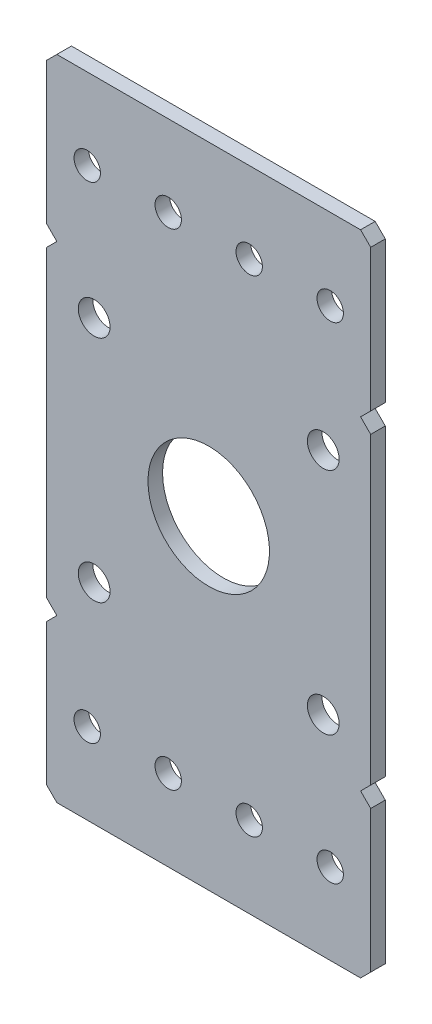
ISO-10303-21;
HEADER;
FILE_DESCRIPTION(('STEP AP214'),'2;1');
FILE_NAME('part.step','',(''),(''),'','','');
FILE_SCHEMA(('AUTOMOTIVE_DESIGN { 1 0 10303 214 1 1 1 1 }'));
ENDSEC;
DATA;
#1=APPLICATION_CONTEXT('core data for automotive mechanical design processes');
#2=APPLICATION_PROTOCOL_DEFINITION('international standard','automotive_design',2000,#1);
#3=PRODUCT_CONTEXT('',#1,'mechanical');
#4=PRODUCT('Part','Part','',(#3));
#5=PRODUCT_RELATED_PRODUCT_CATEGORY('part','',(#4));
#6=PRODUCT_DEFINITION_FORMATION('','',#4);
#7=PRODUCT_DEFINITION_CONTEXT('part definition',#1,'design');
#8=PRODUCT_DEFINITION('design','',#6,#7);
#9=PRODUCT_DEFINITION_SHAPE('','',#8);
#10=(LENGTH_UNIT() NAMED_UNIT(*) SI_UNIT(.MILLI.,.METRE.));
#11=(NAMED_UNIT(*) PLANE_ANGLE_UNIT() SI_UNIT($,.RADIAN.));
#12=(NAMED_UNIT(*) SI_UNIT($,.STERADIAN.) SOLID_ANGLE_UNIT());
#13=UNCERTAINTY_MEASURE_WITH_UNIT(LENGTH_MEASURE(1.E-05),#10,'distance_accuracy_value','');
#14=(GEOMETRIC_REPRESENTATION_CONTEXT(3) GLOBAL_UNCERTAINTY_ASSIGNED_CONTEXT((#13)) GLOBAL_UNIT_ASSIGNED_CONTEXT((#10,
#11,#12)) REPRESENTATION_CONTEXT('',''));
#15=CARTESIAN_POINT('',(0.,0.,0.));
#16=DIRECTION('',(0.,0.,1.));
#17=DIRECTION('',(1.,0.,0.));
#18=AXIS2_PLACEMENT_3D('',#15,#16,#17);
#19=CARTESIAN_POINT('',(25.4,-49.2125,0.));
#20=DIRECTION('',(1.,0.,0.));
#21=DIRECTION('',(0.,1.,0.));
#22=AXIS2_PLACEMENT_3D('',#19,#20,#21);
#23=PLANE('',#22);
#24=DIRECTION('',(0.,1.,0.));
#25=VECTOR('',#24,1.);
#26=CARTESIAN_POINT('',(25.4,-49.2125,2.286));
#27=LINE('',#26,#25);
#28=CARTESIAN_POINT('',(25.4,-49.2125,2.286));
#29=VERTEX_POINT('',#28);
#30=CARTESIAN_POINT('',(25.4,-26.9875,2.286));
#31=VERTEX_POINT('',#30);
#32=EDGE_CURVE('E202',#29,#31,#27,.T.);
#33=ORIENTED_EDGE('',*,*,#32,.F.);
#34=DIRECTION('',(0.,0.,1.));
#35=VECTOR('',#34,1.);
#36=CARTESIAN_POINT('',(25.4,-49.2125,0.));
#37=LINE('',#36,#35);
#38=CARTESIAN_POINT('',(25.4,-49.2125,0.));
#39=VERTEX_POINT('',#38);
#40=EDGE_CURVE('E11',#39,#29,#37,.T.);
#41=ORIENTED_EDGE('',*,*,#40,.F.);
#42=DIRECTION('',(0.,1.,0.));
#43=VECTOR('',#42,1.);
#44=CARTESIAN_POINT('',(25.4,-49.2125,0.));
#45=LINE('',#44,#43);
#46=CARTESIAN_POINT('',(25.4,-26.9875,0.));
#47=VERTEX_POINT('',#46);
#48=EDGE_CURVE('E259',#39,#47,#45,.T.);
#49=ORIENTED_EDGE('',*,*,#48,.T.);
#50=DIRECTION('',(0.,0.,1.));
#51=VECTOR('',#50,1.);
#52=CARTESIAN_POINT('',(25.4,-26.9875,0.));
#53=LINE('',#52,#51);
#54=EDGE_CURVE('E36',#47,#31,#53,.T.);
#55=ORIENTED_EDGE('',*,*,#54,.T.);
#56=EDGE_LOOP('',(#33,#41,#49,#55));
#57=FACE_BOUND('',#56,.T.);
#58=ADVANCED_FACE('F33',(#57),#23,.T.);
#59=CARTESIAN_POINT('',(23.8125,-50.8,0.));
#60=DIRECTION('',(0.707106781186548,-0.707106781186548,0.));
#61=DIRECTION('',(0.707106781186548,0.707106781186548,0.));
#62=AXIS2_PLACEMENT_3D('',#59,#60,#61);
#63=PLANE('',#62);
#64=DIRECTION('',(0.707106781186548,0.707106781186548,0.));
#65=VECTOR('',#64,1.);
#66=CARTESIAN_POINT('',(23.8125,-50.8,2.286));
#67=LINE('',#66,#65);
#68=CARTESIAN_POINT('',(23.8125,-50.8,2.286));
#69=VERTEX_POINT('',#68);
#70=EDGE_CURVE('E257',#69,#29,#67,.T.);
#71=ORIENTED_EDGE('',*,*,#70,.F.);
#72=DIRECTION('',(0.,0.,1.));
#73=VECTOR('',#72,1.);
#74=CARTESIAN_POINT('',(23.8125,-50.8,0.));
#75=LINE('',#74,#73);
#76=CARTESIAN_POINT('',(23.8125,-50.8,0.));
#77=VERTEX_POINT('',#76);
#78=EDGE_CURVE('E42',#77,#69,#75,.T.);
#79=ORIENTED_EDGE('',*,*,#78,.F.);
#80=DIRECTION('',(0.707106781186548,0.707106781186548,0.));
#81=VECTOR('',#80,1.);
#82=CARTESIAN_POINT('',(23.8125,-50.8,0.));
#83=LINE('',#82,#81);
#84=EDGE_CURVE('E192',#77,#39,#83,.T.);
#85=ORIENTED_EDGE('',*,*,#84,.T.);
#86=ORIENTED_EDGE('',*,*,#40,.T.);
#87=EDGE_LOOP('',(#71,#79,#85,#86));
#88=FACE_BOUND('',#87,.T.);
#89=ADVANCED_FACE('F295',(#88),#63,.T.);
#90=CARTESIAN_POINT('',(-23.8125,-50.8,0.));
#91=DIRECTION('',(0.,-1.,0.));
#92=DIRECTION('',(0.,0.,-1.));
#93=AXIS2_PLACEMENT_3D('',#90,#91,#92);
#94=PLANE('',#93);
#95=DIRECTION('',(1.,0.,0.));
#96=VECTOR('',#95,1.);
#97=CARTESIAN_POINT('',(-23.8125,-50.8,2.286));
#98=LINE('',#97,#96);
#99=CARTESIAN_POINT('',(-23.8125,-50.8,2.286));
#100=VERTEX_POINT('',#99);
#101=EDGE_CURVE('E179',#100,#69,#98,.T.);
#102=ORIENTED_EDGE('',*,*,#101,.F.);
#103=DIRECTION('',(0.,0.,1.));
#104=VECTOR('',#103,1.);
#105=CARTESIAN_POINT('',(-23.8125,-50.8,0.));
#106=LINE('',#105,#104);
#107=CARTESIAN_POINT('',(-23.8125,-50.8,0.));
#108=VERTEX_POINT('',#107);
#109=EDGE_CURVE('E174',#108,#100,#106,.T.);
#110=ORIENTED_EDGE('',*,*,#109,.F.);
#111=DIRECTION('',(1.,0.,0.));
#112=VECTOR('',#111,1.);
#113=CARTESIAN_POINT('',(-23.8125,-50.8,0.));
#114=LINE('',#113,#112);
#115=EDGE_CURVE('E177',#108,#77,#114,.T.);
#116=ORIENTED_EDGE('',*,*,#115,.T.);
#117=ORIENTED_EDGE('',*,*,#78,.T.);
#118=EDGE_LOOP('',(#102,#110,#116,#117));
#119=FACE_BOUND('',#118,.T.);
#120=ADVANCED_FACE('F176',(#119),#94,.T.);
#121=CARTESIAN_POINT('',(-25.4,-49.2125,0.));
#122=DIRECTION('',(-0.707106781186548,-0.707106781186548,0.));
#123=DIRECTION('',(0.707106781186548,-0.707106781186548,0.));
#124=AXIS2_PLACEMENT_3D('',#121,#122,#123);
#125=PLANE('',#124);
#126=DIRECTION('',(0.707106781186548,-0.707106781186548,0.));
#127=VECTOR('',#126,1.);
#128=CARTESIAN_POINT('',(-25.4,-49.2125,2.286));
#129=LINE('',#128,#127);
#130=CARTESIAN_POINT('',(-25.4,-49.2125,2.286));
#131=VERTEX_POINT('',#130);
#132=EDGE_CURVE('E254',#131,#100,#129,.T.);
#133=ORIENTED_EDGE('',*,*,#132,.F.);
#134=DIRECTION('',(0.,0.,1.));
#135=VECTOR('',#134,1.);
#136=CARTESIAN_POINT('',(-25.4,-49.2125,0.));
#137=LINE('',#136,#135);
#138=CARTESIAN_POINT('',(-25.4,-49.2125,0.));
#139=VERTEX_POINT('',#138);
#140=EDGE_CURVE('E184',#139,#131,#137,.T.);
#141=ORIENTED_EDGE('',*,*,#140,.F.);
#142=DIRECTION('',(0.707106781186548,-0.707106781186548,0.));
#143=VECTOR('',#142,1.);
#144=CARTESIAN_POINT('',(-25.4,-49.2125,0.));
#145=LINE('',#144,#143);
#146=EDGE_CURVE('E190',#139,#108,#145,.T.);
#147=ORIENTED_EDGE('',*,*,#146,.T.);
#148=ORIENTED_EDGE('',*,*,#109,.T.);
#149=EDGE_LOOP('',(#133,#141,#147,#148));
#150=FACE_BOUND('',#149,.T.);
#151=ADVANCED_FACE('F194',(#150),#125,.T.);
#152=CARTESIAN_POINT('',(-25.4,-26.9875,0.));
#153=DIRECTION('',(-1.,0.,0.));
#154=DIRECTION('',(0.,-1.,0.));
#155=AXIS2_PLACEMENT_3D('',#152,#153,#154);
#156=PLANE('',#155);
#157=DIRECTION('',(0.,-1.,0.));
#158=VECTOR('',#157,1.);
#159=CARTESIAN_POINT('',(-25.4,-26.9875,2.286));
#160=LINE('',#159,#158);
#161=CARTESIAN_POINT('',(-25.4,-26.9875,2.286));
#162=VERTEX_POINT('',#161);
#163=EDGE_CURVE('E251',#162,#131,#160,.T.);
#164=ORIENTED_EDGE('',*,*,#163,.F.);
#165=DIRECTION('',(0.,0.,1.));
#166=VECTOR('',#165,1.);
#167=CARTESIAN_POINT('',(-25.4,-26.9875,0.));
#168=LINE('',#167,#166);
#169=CARTESIAN_POINT('',(-25.4,-26.9875,0.));
#170=VERTEX_POINT('',#169);
#171=EDGE_CURVE('E263',#170,#162,#168,.T.);
#172=ORIENTED_EDGE('',*,*,#171,.F.);
#173=DIRECTION('',(0.,-1.,0.));
#174=VECTOR('',#173,1.);
#175=CARTESIAN_POINT('',(-25.4,-26.9875,0.));
#176=LINE('',#175,#174);
#177=EDGE_CURVE('E195',#170,#139,#176,.T.);
#178=ORIENTED_EDGE('',*,*,#177,.T.);
#179=ORIENTED_EDGE('',*,*,#140,.T.);
#180=EDGE_LOOP('',(#164,#172,#178,#179));
#181=FACE_BOUND('',#180,.T.);
#182=ADVANCED_FACE('F308',(#181),#156,.T.);
#183=CARTESIAN_POINT('',(-23.8125,-25.4,0.));
#184=DIRECTION('',(-0.707106781186554,0.70710678118654,0.));
#185=DIRECTION('',(-0.707106781186541,-0.707106781186555,0.));
#186=AXIS2_PLACEMENT_3D('',#183,#184,#185);
#187=PLANE('',#186);
#188=DIRECTION('',(-0.70710678118654,-0.707106781186554,0.));
#189=VECTOR('',#188,1.);
#190=CARTESIAN_POINT('',(-23.8125,-25.4,2.286));
#191=LINE('',#190,#189);
#192=CARTESIAN_POINT('',(-23.8125,-25.4,2.286));
#193=VERTEX_POINT('',#192);
#194=EDGE_CURVE('E248',#193,#162,#191,.T.);
#195=ORIENTED_EDGE('',*,*,#194,.F.);
#196=DIRECTION('',(0.,0.,1.));
#197=VECTOR('',#196,1.);
#198=CARTESIAN_POINT('',(-23.8125,-25.4,0.));
#199=LINE('',#198,#197);
#200=CARTESIAN_POINT('',(-23.8125,-25.4,0.));
#201=VERTEX_POINT('',#200);
#202=EDGE_CURVE('E265',#201,#193,#199,.T.);
#203=ORIENTED_EDGE('',*,*,#202,.F.);
#204=DIRECTION('',(-0.70710678118654,-0.707106781186554,0.));
#205=VECTOR('',#204,1.);
#206=CARTESIAN_POINT('',(-23.8125,-25.4,0.));
#207=LINE('',#206,#205);
#208=EDGE_CURVE('E197',#201,#170,#207,.T.);
#209=ORIENTED_EDGE('',*,*,#208,.T.);
#210=ORIENTED_EDGE('',*,*,#171,.T.);
#211=EDGE_LOOP('',(#195,#203,#209,#210));
#212=FACE_BOUND('',#211,.T.);
#213=ADVANCED_FACE('F311',(#212),#187,.T.);
#214=CARTESIAN_POINT('',(-25.4,-23.8125,0.));
#215=DIRECTION('',(-0.707106781186542,-0.707106781186553,0.));
#216=DIRECTION('',(0.707106781186553,-0.707106781186542,0.));
#217=AXIS2_PLACEMENT_3D('',#214,#215,#216);
#218=PLANE('',#217);
#219=DIRECTION('',(0.707106781186553,-0.707106781186542,0.));
#220=VECTOR('',#219,1.);
#221=CARTESIAN_POINT('',(-25.4,-23.8125,2.286));
#222=LINE('',#221,#220);
#223=CARTESIAN_POINT('',(-25.4,-23.8125,2.286));
#224=VERTEX_POINT('',#223);
#225=EDGE_CURVE('E245',#224,#193,#222,.T.);
#226=ORIENTED_EDGE('',*,*,#225,.F.);
#227=DIRECTION('',(0.,0.,1.));
#228=VECTOR('',#227,1.);
#229=CARTESIAN_POINT('',(-25.4,-23.8125,0.));
#230=LINE('',#229,#228);
#231=CARTESIAN_POINT('',(-25.4,-23.8125,0.));
#232=VERTEX_POINT('',#231);
#233=EDGE_CURVE('E267',#232,#224,#230,.T.);
#234=ORIENTED_EDGE('',*,*,#233,.F.);
#235=DIRECTION('',(0.707106781186553,-0.707106781186542,0.));
#236=VECTOR('',#235,1.);
#237=CARTESIAN_POINT('',(-25.4,-23.8125,0.));
#238=LINE('',#237,#236);
#239=EDGE_CURVE('E551',#232,#201,#238,.T.);
#240=ORIENTED_EDGE('',*,*,#239,.T.);
#241=ORIENTED_EDGE('',*,*,#202,.T.);
#242=EDGE_LOOP('',(#226,#234,#240,#241));
#243=FACE_BOUND('',#242,.T.);
#244=ADVANCED_FACE('F315',(#243),#218,.T.);
#245=CARTESIAN_POINT('',(-25.4,23.8125,0.));
#246=DIRECTION('',(-1.,0.,0.));
#247=DIRECTION('',(0.,-1.,0.));
#248=AXIS2_PLACEMENT_3D('',#245,#246,#247);
#249=PLANE('',#248);
#250=DIRECTION('',(0.,-1.,0.));
#251=VECTOR('',#250,1.);
#252=CARTESIAN_POINT('',(-25.4,23.8125,2.286));
#253=LINE('',#252,#251);
#254=CARTESIAN_POINT('',(-25.4,23.8125,2.286));
#255=VERTEX_POINT('',#254);
#256=EDGE_CURVE('E242',#255,#224,#253,.T.);
#257=ORIENTED_EDGE('',*,*,#256,.F.);
#258=DIRECTION('',(0.,0.,1.));
#259=VECTOR('',#258,1.);
#260=CARTESIAN_POINT('',(-25.4,23.8125,0.));
#261=LINE('',#260,#259);
#262=CARTESIAN_POINT('',(-25.4,23.8125,0.));
#263=VERTEX_POINT('',#262);
#264=EDGE_CURVE('E269',#263,#255,#261,.T.);
#265=ORIENTED_EDGE('',*,*,#264,.F.);
#266=DIRECTION('',(0.,-1.,0.));
#267=VECTOR('',#266,1.);
#268=CARTESIAN_POINT('',(-25.4,23.8125,0.));
#269=LINE('',#268,#267);
#270=EDGE_CURVE('E548',#263,#232,#269,.T.);
#271=ORIENTED_EDGE('',*,*,#270,.T.);
#272=ORIENTED_EDGE('',*,*,#233,.T.);
#273=EDGE_LOOP('',(#257,#265,#271,#272));
#274=FACE_BOUND('',#273,.T.);
#275=ADVANCED_FACE('F319',(#274),#249,.T.);
#276=CARTESIAN_POINT('',(-23.8125,25.4,0.));
#277=DIRECTION('',(-0.707106781186551,0.707106781186544,0.));
#278=DIRECTION('',(-0.707106781186544,-0.707106781186551,0.));
#279=AXIS2_PLACEMENT_3D('',#276,#277,#278);
#280=PLANE('',#279);
#281=DIRECTION('',(-0.707106781186544,-0.707106781186551,0.));
#282=VECTOR('',#281,1.);
#283=CARTESIAN_POINT('',(-23.8125,25.4,2.286));
#284=LINE('',#283,#282);
#285=CARTESIAN_POINT('',(-23.8125,25.4,2.286));
#286=VERTEX_POINT('',#285);
#287=EDGE_CURVE('E239',#286,#255,#284,.T.);
#288=ORIENTED_EDGE('',*,*,#287,.F.);
#289=DIRECTION('',(0.,0.,1.));
#290=VECTOR('',#289,1.);
#291=CARTESIAN_POINT('',(-23.8125,25.4,0.));
#292=LINE('',#291,#290);
#293=CARTESIAN_POINT('',(-23.8125,25.4,0.));
#294=VERTEX_POINT('',#293);
#295=EDGE_CURVE('E271',#294,#286,#292,.T.);
#296=ORIENTED_EDGE('',*,*,#295,.F.);
#297=DIRECTION('',(-0.707106781186544,-0.707106781186551,0.));
#298=VECTOR('',#297,1.);
#299=CARTESIAN_POINT('',(-23.8125,25.4,0.));
#300=LINE('',#299,#298);
#301=EDGE_CURVE('E545',#294,#263,#300,.T.);
#302=ORIENTED_EDGE('',*,*,#301,.T.);
#303=ORIENTED_EDGE('',*,*,#264,.T.);
#304=EDGE_LOOP('',(#288,#296,#302,#303));
#305=FACE_BOUND('',#304,.T.);
#306=ADVANCED_FACE('F323',(#305),#280,.T.);
#307=CARTESIAN_POINT('',(-25.4,26.9875,0.));
#308=DIRECTION('',(-0.707106781186543,-0.707106781186552,0.));
#309=DIRECTION('',(0.707106781186552,-0.707106781186543,0.));
#310=AXIS2_PLACEMENT_3D('',#307,#308,#309);
#311=PLANE('',#310);
#312=DIRECTION('',(0.707106781186552,-0.707106781186543,0.));
#313=VECTOR('',#312,1.);
#314=CARTESIAN_POINT('',(-25.4,26.9875,2.286));
#315=LINE('',#314,#313);
#316=CARTESIAN_POINT('',(-25.4,26.9875,2.286));
#317=VERTEX_POINT('',#316);
#318=EDGE_CURVE('E236',#317,#286,#315,.T.);
#319=ORIENTED_EDGE('',*,*,#318,.F.);
#320=DIRECTION('',(0.,0.,1.));
#321=VECTOR('',#320,1.);
#322=CARTESIAN_POINT('',(-25.4,26.9875,0.));
#323=LINE('',#322,#321);
#324=CARTESIAN_POINT('',(-25.4,26.9875,0.));
#325=VERTEX_POINT('',#324);
#326=EDGE_CURVE('E273',#325,#317,#323,.T.);
#327=ORIENTED_EDGE('',*,*,#326,.F.);
#328=DIRECTION('',(0.707106781186552,-0.707106781186543,0.));
#329=VECTOR('',#328,1.);
#330=CARTESIAN_POINT('',(-25.4,26.9875,0.));
#331=LINE('',#330,#329);
#332=EDGE_CURVE('E542',#325,#294,#331,.T.);
#333=ORIENTED_EDGE('',*,*,#332,.T.);
#334=ORIENTED_EDGE('',*,*,#295,.T.);
#335=EDGE_LOOP('',(#319,#327,#333,#334));
#336=FACE_BOUND('',#335,.T.);
#337=ADVANCED_FACE('F327',(#336),#311,.T.);
#338=CARTESIAN_POINT('',(-25.4,49.2125,0.));
#339=DIRECTION('',(-1.,0.,0.));
#340=DIRECTION('',(0.,0.,1.));
#341=AXIS2_PLACEMENT_3D('',#338,#339,#340);
#342=PLANE('',#341);
#343=DIRECTION('',(0.,-1.,0.));
#344=VECTOR('',#343,1.);
#345=CARTESIAN_POINT('',(-25.4,49.2125,2.286));
#346=LINE('',#345,#344);
#347=CARTESIAN_POINT('',(-25.4,49.2125,2.286));
#348=VERTEX_POINT('',#347);
#349=EDGE_CURVE('E233',#348,#317,#346,.T.);
#350=ORIENTED_EDGE('',*,*,#349,.F.);
#351=DIRECTION('',(0.,0.,1.));
#352=VECTOR('',#351,1.);
#353=CARTESIAN_POINT('',(-25.4,49.2125,0.));
#354=LINE('',#353,#352);
#355=CARTESIAN_POINT('',(-25.4,49.2125,0.));
#356=VERTEX_POINT('',#355);
#357=EDGE_CURVE('E275',#356,#348,#354,.T.);
#358=ORIENTED_EDGE('',*,*,#357,.F.);
#359=DIRECTION('',(0.,-1.,0.));
#360=VECTOR('',#359,1.);
#361=CARTESIAN_POINT('',(-25.4,49.2125,0.));
#362=LINE('',#361,#360);
#363=EDGE_CURVE('E539',#356,#325,#362,.T.);
#364=ORIENTED_EDGE('',*,*,#363,.T.);
#365=ORIENTED_EDGE('',*,*,#326,.T.);
#366=EDGE_LOOP('',(#350,#358,#364,#365));
#367=FACE_BOUND('',#366,.T.);
#368=ADVANCED_FACE('F331',(#367),#342,.T.);
#369=CARTESIAN_POINT('',(-23.8125,50.8,0.));
#370=DIRECTION('',(-0.707106781186551,0.707106781186544,0.));
#371=DIRECTION('',(-0.707106781186544,-0.707106781186551,0.));
#372=AXIS2_PLACEMENT_3D('',#369,#370,#371);
#373=PLANE('',#372);
#374=DIRECTION('',(-0.707106781186544,-0.707106781186551,0.));
#375=VECTOR('',#374,1.);
#376=CARTESIAN_POINT('',(-23.8125,50.8,2.286));
#377=LINE('',#376,#375);
#378=CARTESIAN_POINT('',(-23.8125,50.8,2.286));
#379=VERTEX_POINT('',#378);
#380=EDGE_CURVE('E230',#379,#348,#377,.T.);
#381=ORIENTED_EDGE('',*,*,#380,.F.);
#382=DIRECTION('',(0.,0.,1.));
#383=VECTOR('',#382,1.);
#384=CARTESIAN_POINT('',(-23.8125,50.8,0.));
#385=LINE('',#384,#383);
#386=CARTESIAN_POINT('',(-23.8125,50.8,0.));
#387=VERTEX_POINT('',#386);
#388=EDGE_CURVE('E277',#387,#379,#385,.T.);
#389=ORIENTED_EDGE('',*,*,#388,.F.);
#390=DIRECTION('',(-0.707106781186544,-0.707106781186551,0.));
#391=VECTOR('',#390,1.);
#392=CARTESIAN_POINT('',(-23.8125,50.8,0.));
#393=LINE('',#392,#391);
#394=EDGE_CURVE('E536',#387,#356,#393,.T.);
#395=ORIENTED_EDGE('',*,*,#394,.T.);
#396=ORIENTED_EDGE('',*,*,#357,.T.);
#397=EDGE_LOOP('',(#381,#389,#395,#396));
#398=FACE_BOUND('',#397,.T.);
#399=ADVANCED_FACE('F335',(#398),#373,.T.);
#400=CARTESIAN_POINT('',(23.8125,50.8,0.));
#401=DIRECTION('',(0.,1.,0.));
#402=DIRECTION('',(0.,0.,1.));
#403=AXIS2_PLACEMENT_3D('',#400,#401,#402);
#404=PLANE('',#403);
#405=DIRECTION('',(-1.,0.,0.));
#406=VECTOR('',#405,1.);
#407=CARTESIAN_POINT('',(23.8125,50.8,2.286));
#408=LINE('',#407,#406);
#409=CARTESIAN_POINT('',(23.8125,50.8,2.286));
#410=VERTEX_POINT('',#409);
#411=EDGE_CURVE('E227',#410,#379,#408,.T.);
#412=ORIENTED_EDGE('',*,*,#411,.F.);
#413=DIRECTION('',(0.,0.,1.));
#414=VECTOR('',#413,1.);
#415=CARTESIAN_POINT('',(23.8125,50.8,0.));
#416=LINE('',#415,#414);
#417=CARTESIAN_POINT('',(23.8125,50.8,0.));
#418=VERTEX_POINT('',#417);
#419=EDGE_CURVE('E279',#418,#410,#416,.T.);
#420=ORIENTED_EDGE('',*,*,#419,.F.);
#421=DIRECTION('',(-1.,0.,0.));
#422=VECTOR('',#421,1.);
#423=CARTESIAN_POINT('',(23.8125,50.8,0.));
#424=LINE('',#423,#422);
#425=EDGE_CURVE('E533',#418,#387,#424,.T.);
#426=ORIENTED_EDGE('',*,*,#425,.T.);
#427=ORIENTED_EDGE('',*,*,#388,.T.);
#428=EDGE_LOOP('',(#412,#420,#426,#427));
#429=FACE_BOUND('',#428,.T.);
#430=ADVANCED_FACE('F339',(#429),#404,.T.);
#431=CARTESIAN_POINT('',(25.4,49.2125,0.));
#432=DIRECTION('',(0.707106781186547,0.707106781186548,0.));
#433=DIRECTION('',(-0.707106781186548,0.707106781186547,0.));
#434=AXIS2_PLACEMENT_3D('',#431,#432,#433);
#435=PLANE('',#434);
#436=DIRECTION('',(-0.707106781186548,0.707106781186547,0.));
#437=VECTOR('',#436,1.);
#438=CARTESIAN_POINT('',(25.4,49.2125,2.286));
#439=LINE('',#438,#437);
#440=CARTESIAN_POINT('',(25.4,49.2125,2.286));
#441=VERTEX_POINT('',#440);
#442=EDGE_CURVE('E224',#441,#410,#439,.T.);
#443=ORIENTED_EDGE('',*,*,#442,.F.);
#444=DIRECTION('',(0.,0.,1.));
#445=VECTOR('',#444,1.);
#446=CARTESIAN_POINT('',(25.4,49.2125,0.));
#447=LINE('',#446,#445);
#448=CARTESIAN_POINT('',(25.4,49.2125,0.));
#449=VERTEX_POINT('',#448);
#450=EDGE_CURVE('E281',#449,#441,#447,.T.);
#451=ORIENTED_EDGE('',*,*,#450,.F.);
#452=DIRECTION('',(-0.707106781186548,0.707106781186547,0.));
#453=VECTOR('',#452,1.);
#454=CARTESIAN_POINT('',(25.4,49.2125,0.));
#455=LINE('',#454,#453);
#456=EDGE_CURVE('E530',#449,#418,#455,.T.);
#457=ORIENTED_EDGE('',*,*,#456,.T.);
#458=ORIENTED_EDGE('',*,*,#419,.T.);
#459=EDGE_LOOP('',(#443,#451,#457,#458));
#460=FACE_BOUND('',#459,.T.);
#461=ADVANCED_FACE('F343',(#460),#435,.T.);
#462=CARTESIAN_POINT('',(25.4,26.9875,0.));
#463=DIRECTION('',(1.,0.,0.));
#464=DIRECTION('',(0.,0.,-1.));
#465=AXIS2_PLACEMENT_3D('',#462,#463,#464);
#466=PLANE('',#465);
#467=DIRECTION('',(0.,1.,0.));
#468=VECTOR('',#467,1.);
#469=CARTESIAN_POINT('',(25.4,26.9875,2.286));
#470=LINE('',#469,#468);
#471=CARTESIAN_POINT('',(25.4,26.9875,2.286));
#472=VERTEX_POINT('',#471);
#473=EDGE_CURVE('E221',#472,#441,#470,.T.);
#474=ORIENTED_EDGE('',*,*,#473,.F.);
#475=DIRECTION('',(0.,0.,1.));
#476=VECTOR('',#475,1.);
#477=CARTESIAN_POINT('',(25.4,26.9875,0.));
#478=LINE('',#477,#476);
#479=CARTESIAN_POINT('',(25.4,26.9875,0.));
#480=VERTEX_POINT('',#479);
#481=EDGE_CURVE('E283',#480,#472,#478,.T.);
#482=ORIENTED_EDGE('',*,*,#481,.F.);
#483=DIRECTION('',(0.,1.,0.));
#484=VECTOR('',#483,1.);
#485=CARTESIAN_POINT('',(25.4,26.9875,0.));
#486=LINE('',#485,#484);
#487=EDGE_CURVE('E527',#480,#449,#486,.T.);
#488=ORIENTED_EDGE('',*,*,#487,.T.);
#489=ORIENTED_EDGE('',*,*,#450,.T.);
#490=EDGE_LOOP('',(#474,#482,#488,#489));
#491=FACE_BOUND('',#490,.T.);
#492=ADVANCED_FACE('F347',(#491),#466,.T.);
#493=CARTESIAN_POINT('',(23.8125,25.4,0.));
#494=DIRECTION('',(0.707106781186552,-0.707106781186543,0.));
#495=DIRECTION('',(0.707106781186543,0.707106781186552,0.));
#496=AXIS2_PLACEMENT_3D('',#493,#494,#495);
#497=PLANE('',#496);
#498=DIRECTION('',(0.707106781186543,0.707106781186552,0.));
#499=VECTOR('',#498,1.);
#500=CARTESIAN_POINT('',(23.8125,25.4,2.286));
#501=LINE('',#500,#499);
#502=CARTESIAN_POINT('',(23.8125,25.4,2.286));
#503=VERTEX_POINT('',#502);
#504=EDGE_CURVE('E218',#503,#472,#501,.T.);
#505=ORIENTED_EDGE('',*,*,#504,.F.);
#506=DIRECTION('',(0.,0.,1.));
#507=VECTOR('',#506,1.);
#508=CARTESIAN_POINT('',(23.8125,25.4,0.));
#509=LINE('',#508,#507);
#510=CARTESIAN_POINT('',(23.8125,25.4,0.));
#511=VERTEX_POINT('',#510);
#512=EDGE_CURVE('E285',#511,#503,#509,.T.);
#513=ORIENTED_EDGE('',*,*,#512,.F.);
#514=DIRECTION('',(0.707106781186543,0.707106781186552,0.));
#515=VECTOR('',#514,1.);
#516=CARTESIAN_POINT('',(23.8125,25.4,0.));
#517=LINE('',#516,#515);
#518=EDGE_CURVE('E524',#511,#480,#517,.T.);
#519=ORIENTED_EDGE('',*,*,#518,.T.);
#520=ORIENTED_EDGE('',*,*,#481,.T.);
#521=EDGE_LOOP('',(#505,#513,#519,#520));
#522=FACE_BOUND('',#521,.T.);
#523=ADVANCED_FACE('F351',(#522),#497,.T.);
#524=CARTESIAN_POINT('',(25.4,23.8125,0.));
#525=DIRECTION('',(0.707106781186546,0.707106781186549,0.));
#526=DIRECTION('',(-0.707106781186549,0.707106781186546,0.));
#527=AXIS2_PLACEMENT_3D('',#524,#525,#526);
#528=PLANE('',#527);
#529=DIRECTION('',(-0.707106781186549,0.707106781186546,0.));
#530=VECTOR('',#529,1.);
#531=CARTESIAN_POINT('',(25.4,23.8125,2.286));
#532=LINE('',#531,#530);
#533=CARTESIAN_POINT('',(25.4,23.8125,2.286));
#534=VERTEX_POINT('',#533);
#535=EDGE_CURVE('E215',#534,#503,#532,.T.);
#536=ORIENTED_EDGE('',*,*,#535,.F.);
#537=DIRECTION('',(0.,0.,1.));
#538=VECTOR('',#537,1.);
#539=CARTESIAN_POINT('',(25.4,23.8125,0.));
#540=LINE('',#539,#538);
#541=CARTESIAN_POINT('',(25.4,23.8125,0.));
#542=VERTEX_POINT('',#541);
#543=EDGE_CURVE('E287',#542,#534,#540,.T.);
#544=ORIENTED_EDGE('',*,*,#543,.F.);
#545=DIRECTION('',(-0.707106781186549,0.707106781186546,0.));
#546=VECTOR('',#545,1.);
#547=CARTESIAN_POINT('',(25.4,23.8125,0.));
#548=LINE('',#547,#546);
#549=EDGE_CURVE('E521',#542,#511,#548,.T.);
#550=ORIENTED_EDGE('',*,*,#549,.T.);
#551=ORIENTED_EDGE('',*,*,#512,.T.);
#552=EDGE_LOOP('',(#536,#544,#550,#551));
#553=FACE_BOUND('',#552,.T.);
#554=ADVANCED_FACE('F355',(#553),#528,.T.);
#555=CARTESIAN_POINT('',(25.4,-23.8125,0.));
#556=DIRECTION('',(1.,0.,0.));
#557=DIRECTION('',(0.,0.,-1.));
#558=AXIS2_PLACEMENT_3D('',#555,#556,#557);
#559=PLANE('',#558);
#560=DIRECTION('',(0.,1.,0.));
#561=VECTOR('',#560,1.);
#562=CARTESIAN_POINT('',(25.4,-23.8125,2.286));
#563=LINE('',#562,#561);
#564=CARTESIAN_POINT('',(25.4,-23.8125,2.286));
#565=VERTEX_POINT('',#564);
#566=EDGE_CURVE('E212',#565,#534,#563,.T.);
#567=ORIENTED_EDGE('',*,*,#566,.F.);
#568=DIRECTION('',(0.,0.,1.));
#569=VECTOR('',#568,1.);
#570=CARTESIAN_POINT('',(25.4,-23.8125,0.));
#571=LINE('',#570,#569);
#572=CARTESIAN_POINT('',(25.4,-23.8125,0.));
#573=VERTEX_POINT('',#572);
#574=EDGE_CURVE('E289',#573,#565,#571,.T.);
#575=ORIENTED_EDGE('',*,*,#574,.F.);
#576=DIRECTION('',(0.,1.,0.));
#577=VECTOR('',#576,1.);
#578=CARTESIAN_POINT('',(25.4,-23.8125,0.));
#579=LINE('',#578,#577);
#580=EDGE_CURVE('E518',#573,#542,#579,.T.);
#581=ORIENTED_EDGE('',*,*,#580,.T.);
#582=ORIENTED_EDGE('',*,*,#543,.T.);
#583=EDGE_LOOP('',(#567,#575,#581,#582));
#584=FACE_BOUND('',#583,.T.);
#585=ADVANCED_FACE('F359',(#584),#559,.T.);
#586=CARTESIAN_POINT('',(23.8125,-25.4,0.));
#587=DIRECTION('',(0.707106781186539,-0.707106781186556,0.));
#588=DIRECTION('',(0.707106781186556,0.707106781186539,0.));
#589=AXIS2_PLACEMENT_3D('',#586,#587,#588);
#590=PLANE('',#589);
#591=DIRECTION('',(0.707106781186556,0.707106781186539,0.));
#592=VECTOR('',#591,1.);
#593=CARTESIAN_POINT('',(23.8125,-25.4,2.286));
#594=LINE('',#593,#592);
#595=CARTESIAN_POINT('',(23.8125,-25.4,2.286));
#596=VERTEX_POINT('',#595);
#597=EDGE_CURVE('E209',#596,#565,#594,.T.);
#598=ORIENTED_EDGE('',*,*,#597,.F.);
#599=DIRECTION('',(0.,0.,1.));
#600=VECTOR('',#599,1.);
#601=CARTESIAN_POINT('',(23.8125,-25.4,0.));
#602=LINE('',#601,#600);
#603=CARTESIAN_POINT('',(23.8125,-25.4,0.));
#604=VERTEX_POINT('',#603);
#605=EDGE_CURVE('E290',#604,#596,#602,.T.);
#606=ORIENTED_EDGE('',*,*,#605,.F.);
#607=DIRECTION('',(0.707106781186556,0.707106781186539,0.));
#608=VECTOR('',#607,1.);
#609=CARTESIAN_POINT('',(23.8125,-25.4,0.));
#610=LINE('',#609,#608);
#611=EDGE_CURVE('E515',#604,#573,#610,.T.);
#612=ORIENTED_EDGE('',*,*,#611,.T.);
#613=ORIENTED_EDGE('',*,*,#574,.T.);
#614=EDGE_LOOP('',(#598,#606,#612,#613));
#615=FACE_BOUND('',#614,.T.);
#616=ADVANCED_FACE('F363',(#615),#590,.T.);
#617=CARTESIAN_POINT('',(25.4,-26.9875,0.));
#618=DIRECTION('',(0.707106781186552,0.707106781186543,0.));
#619=DIRECTION('',(-0.707106781186543,0.707106781186552,0.));
#620=AXIS2_PLACEMENT_3D('',#617,#618,#619);
#621=PLANE('',#620);
#622=DIRECTION('',(-0.707106781186543,0.707106781186552,0.));
#623=VECTOR('',#622,1.);
#624=CARTESIAN_POINT('',(25.4,-26.9875,2.286));
#625=LINE('',#624,#623);
#626=EDGE_CURVE('E205',#31,#596,#625,.T.);
#627=ORIENTED_EDGE('',*,*,#626,.F.);
#628=ORIENTED_EDGE('',*,*,#54,.F.);
#629=DIRECTION('',(-0.707106781186543,0.707106781186552,0.));
#630=VECTOR('',#629,1.);
#631=CARTESIAN_POINT('',(25.4,-26.9875,0.));
#632=LINE('',#631,#630);
#633=EDGE_CURVE('E513',#47,#604,#632,.T.);
#634=ORIENTED_EDGE('',*,*,#633,.T.);
#635=ORIENTED_EDGE('',*,*,#605,.T.);
#636=EDGE_LOOP('',(#627,#628,#634,#635));
#637=FACE_BOUND('',#636,.T.);
#638=ADVANCED_FACE('F292',(#637),#621,.T.);
#639=CARTESIAN_POINT('',(0.,0.,0.));
#640=DIRECTION('',(0.,0.,1.));
#641=DIRECTION('',(1.,0.,0.));
#642=AXIS2_PLACEMENT_3D('',#639,#640,#641);
#643=PLANE('',#642);
#644=CARTESIAN_POINT('',(17.9605122421383,17.9605122421383,0.));
#645=DIRECTION('',(0.,0.,1.));
#646=DIRECTION('',(-1.,0.,0.));
#647=AXIS2_PLACEMENT_3D('',#644,#645,#646);
#648=CIRCLE('',#647,2.4892);
#649=CARTESIAN_POINT('',(15.4713122421383,17.9605122421383,0.));
#650=VERTEX_POINT('',#649);
#651=EDGE_CURVE('E434',#650,#650,#648,.T.);
#652=ORIENTED_EDGE('',*,*,#651,.T.);
#653=EDGE_LOOP('',(#652));
#654=FACE_BOUND('',#653,.T.);
#655=CARTESIAN_POINT('',(17.9605122421383,-17.9605122421383,0.));
#656=DIRECTION('',(0.,0.,1.));
#657=DIRECTION('',(-1.,0.,0.));
#658=AXIS2_PLACEMENT_3D('',#655,#656,#657);
#659=CIRCLE('',#658,2.4892);
#660=CARTESIAN_POINT('',(15.4713122421383,-17.9605122421383,0.));
#661=VERTEX_POINT('',#660);
#662=EDGE_CURVE('E442',#661,#661,#659,.T.);
#663=ORIENTED_EDGE('',*,*,#662,.T.);
#664=EDGE_LOOP('',(#663));
#665=FACE_BOUND('',#664,.T.);
#666=CARTESIAN_POINT('',(6.34999999999999,-38.1,0.));
#667=DIRECTION('',(0.,0.,1.));
#668=DIRECTION('',(-1.,0.,0.));
#669=AXIS2_PLACEMENT_3D('',#666,#667,#668);
#670=CIRCLE('',#669,2.07009999999999);
#671=CARTESIAN_POINT('',(4.2799,-38.1,0.));
#672=VERTEX_POINT('',#671);
#673=EDGE_CURVE('E448',#672,#672,#670,.T.);
#674=ORIENTED_EDGE('',*,*,#673,.T.);
#675=EDGE_LOOP('',(#674));
#676=FACE_BOUND('',#675,.T.);
#677=CARTESIAN_POINT('',(-17.9605122421383,17.9605122421383,0.));
#678=DIRECTION('',(0.,0.,1.));
#679=DIRECTION('',(-1.,0.,0.));
#680=AXIS2_PLACEMENT_3D('',#677,#678,#679);
#681=CIRCLE('',#680,2.4892);
#682=CARTESIAN_POINT('',(-20.4497122421383,17.9605122421383,0.));
#683=VERTEX_POINT('',#682);
#684=EDGE_CURVE('E454',#683,#683,#681,.T.);
#685=ORIENTED_EDGE('',*,*,#684,.T.);
#686=EDGE_LOOP('',(#685));
#687=FACE_BOUND('',#686,.T.);
#688=CARTESIAN_POINT('',(19.05,38.1,0.));
#689=DIRECTION('',(0.,0.,1.));
#690=DIRECTION('',(-1.,0.,0.));
#691=AXIS2_PLACEMENT_3D('',#688,#689,#690);
#692=CIRCLE('',#691,2.07009999999999);
#693=CARTESIAN_POINT('',(16.9799,38.1,0.));
#694=VERTEX_POINT('',#693);
#695=EDGE_CURVE('E460',#694,#694,#692,.T.);
#696=ORIENTED_EDGE('',*,*,#695,.T.);
#697=EDGE_LOOP('',(#696));
#698=FACE_BOUND('',#697,.T.);
#699=CARTESIAN_POINT('',(-6.35000000000001,38.1,0.));
#700=DIRECTION('',(0.,0.,1.));
#701=DIRECTION('',(-1.,0.,0.));
#702=AXIS2_PLACEMENT_3D('',#699,#700,#701);
#703=CIRCLE('',#702,2.07009999999999);
#704=CARTESIAN_POINT('',(-8.4201,38.1,0.));
#705=VERTEX_POINT('',#704);
#706=EDGE_CURVE('E466',#705,#705,#703,.T.);
#707=ORIENTED_EDGE('',*,*,#706,.T.);
#708=EDGE_LOOP('',(#707));
#709=FACE_BOUND('',#708,.T.);
#710=CARTESIAN_POINT('',(-19.05,38.1,0.));
#711=DIRECTION('',(0.,0.,1.));
#712=DIRECTION('',(-1.,0.,0.));
#713=AXIS2_PLACEMENT_3D('',#710,#711,#712);
#714=CIRCLE('',#713,2.0701);
#715=CARTESIAN_POINT('',(-21.1201,38.1,0.));
#716=VERTEX_POINT('',#715);
#717=EDGE_CURVE('E472',#716,#716,#714,.T.);
#718=ORIENTED_EDGE('',*,*,#717,.T.);
#719=EDGE_LOOP('',(#718));
#720=FACE_BOUND('',#719,.T.);
#721=CARTESIAN_POINT('',(6.34999999999999,38.1,0.));
#722=DIRECTION('',(0.,0.,1.));
#723=DIRECTION('',(-1.,0.,0.));
#724=AXIS2_PLACEMENT_3D('',#721,#722,#723);
#725=CIRCLE('',#724,2.07009999999999);
#726=CARTESIAN_POINT('',(4.2799,38.1,0.));
#727=VERTEX_POINT('',#726);
#728=EDGE_CURVE('E478',#727,#727,#725,.T.);
#729=ORIENTED_EDGE('',*,*,#728,.T.);
#730=EDGE_LOOP('',(#729));
#731=FACE_BOUND('',#730,.T.);
#732=CARTESIAN_POINT('',(0.,0.,0.));
#733=DIRECTION('',(0.,0.,1.));
#734=DIRECTION('',(-1.,0.,0.));
#735=AXIS2_PLACEMENT_3D('',#732,#733,#734);
#736=CIRCLE('',#735,9.525);
#737=CARTESIAN_POINT('',(-9.525,0.,0.));
#738=VERTEX_POINT('',#737);
#739=EDGE_CURVE('E484',#738,#738,#736,.T.);
#740=ORIENTED_EDGE('',*,*,#739,.T.);
#741=EDGE_LOOP('',(#740));
#742=FACE_BOUND('',#741,.T.);
#743=CARTESIAN_POINT('',(19.05,-38.1,0.));
#744=DIRECTION('',(0.,0.,1.));
#745=DIRECTION('',(-1.,0.,0.));
#746=AXIS2_PLACEMENT_3D('',#743,#744,#745);
#747=CIRCLE('',#746,2.07009999999999);
#748=CARTESIAN_POINT('',(16.9799,-38.1,0.));
#749=VERTEX_POINT('',#748);
#750=EDGE_CURVE('E490',#749,#749,#747,.T.);
#751=ORIENTED_EDGE('',*,*,#750,.T.);
#752=EDGE_LOOP('',(#751));
#753=FACE_BOUND('',#752,.T.);
#754=CARTESIAN_POINT('',(-6.35000000000001,-38.1,0.));
#755=DIRECTION('',(0.,0.,1.));
#756=DIRECTION('',(-1.,0.,0.));
#757=AXIS2_PLACEMENT_3D('',#754,#755,#756);
#758=CIRCLE('',#757,2.07009999999999);
#759=CARTESIAN_POINT('',(-8.4201,-38.1,0.));
#760=VERTEX_POINT('',#759);
#761=EDGE_CURVE('E496',#760,#760,#758,.T.);
#762=ORIENTED_EDGE('',*,*,#761,.T.);
#763=EDGE_LOOP('',(#762));
#764=FACE_BOUND('',#763,.T.);
#765=CARTESIAN_POINT('',(-19.05,-38.1,0.));
#766=DIRECTION('',(0.,0.,1.));
#767=DIRECTION('',(-1.,0.,0.));
#768=AXIS2_PLACEMENT_3D('',#765,#766,#767);
#769=CIRCLE('',#768,2.0701);
#770=CARTESIAN_POINT('',(-21.1201,-38.1,0.));
#771=VERTEX_POINT('',#770);
#772=EDGE_CURVE('E502',#771,#771,#769,.T.);
#773=ORIENTED_EDGE('',*,*,#772,.T.);
#774=EDGE_LOOP('',(#773));
#775=FACE_BOUND('',#774,.T.);
#776=CARTESIAN_POINT('',(-17.9605122421383,-17.9605122421383,0.));
#777=DIRECTION('',(0.,0.,1.));
#778=DIRECTION('',(-1.,0.,0.));
#779=AXIS2_PLACEMENT_3D('',#776,#777,#778);
#780=CIRCLE('',#779,2.4892);
#781=CARTESIAN_POINT('',(-20.4497122421383,-17.9605122421383,0.));
#782=VERTEX_POINT('',#781);
#783=EDGE_CURVE('E206',#782,#782,#780,.T.);
#784=ORIENTED_EDGE('',*,*,#783,.T.);
#785=EDGE_LOOP('',(#784));
#786=FACE_BOUND('',#785,.T.);
#787=ORIENTED_EDGE('',*,*,#48,.F.);
#788=ORIENTED_EDGE('',*,*,#84,.F.);
#789=ORIENTED_EDGE('',*,*,#115,.F.);
#790=ORIENTED_EDGE('',*,*,#146,.F.);
#791=ORIENTED_EDGE('',*,*,#177,.F.);
#792=ORIENTED_EDGE('',*,*,#208,.F.);
#793=ORIENTED_EDGE('',*,*,#239,.F.);
#794=ORIENTED_EDGE('',*,*,#270,.F.);
#795=ORIENTED_EDGE('',*,*,#301,.F.);
#796=ORIENTED_EDGE('',*,*,#332,.F.);
#797=ORIENTED_EDGE('',*,*,#363,.F.);
#798=ORIENTED_EDGE('',*,*,#394,.F.);
#799=ORIENTED_EDGE('',*,*,#425,.F.);
#800=ORIENTED_EDGE('',*,*,#456,.F.);
#801=ORIENTED_EDGE('',*,*,#487,.F.);
#802=ORIENTED_EDGE('',*,*,#518,.F.);
#803=ORIENTED_EDGE('',*,*,#549,.F.);
#804=ORIENTED_EDGE('',*,*,#580,.F.);
#805=ORIENTED_EDGE('',*,*,#611,.F.);
#806=ORIENTED_EDGE('',*,*,#633,.F.);
#807=EDGE_LOOP('',(#787,#788,#789,#790,#791,#792,#793,#794,#795,#796,#797,#798,#799,#800,#801,
#802,#803,#804,#805,#806));
#808=FACE_BOUND('',#807,.T.);
#809=ADVANCED_FACE('F188',(#654,#665,#676,#687,#698,#709,#720,#731,#742,#753,#764,#775,#786,
#808),#643,.F.);
#810=CARTESIAN_POINT('',(0.,0.,2.286));
#811=DIRECTION('',(0.,0.,1.));
#812=DIRECTION('',(1.,0.,0.));
#813=AXIS2_PLACEMENT_3D('',#810,#811,#812);
#814=PLANE('',#813);
#815=CARTESIAN_POINT('',(17.9605122421383,17.9605122421383,2.286));
#816=DIRECTION('',(0.,0.,1.));
#817=DIRECTION('',(-1.,0.,0.));
#818=AXIS2_PLACEMENT_3D('',#815,#816,#817);
#819=CIRCLE('',#818,2.4892);
#820=CARTESIAN_POINT('',(15.4713122421383,17.9605122421383,2.286));
#821=VERTEX_POINT('',#820);
#822=EDGE_CURVE('E437',#821,#821,#819,.T.);
#823=ORIENTED_EDGE('',*,*,#822,.F.);
#824=EDGE_LOOP('',(#823));
#825=FACE_BOUND('',#824,.T.);
#826=CARTESIAN_POINT('',(17.9605122421383,-17.9605122421383,2.286));
#827=DIRECTION('',(0.,0.,1.));
#828=DIRECTION('',(-1.,0.,0.));
#829=AXIS2_PLACEMENT_3D('',#826,#827,#828);
#830=CIRCLE('',#829,2.4892);
#831=CARTESIAN_POINT('',(15.4713122421383,-17.9605122421383,2.286));
#832=VERTEX_POINT('',#831);
#833=EDGE_CURVE('E439',#832,#832,#830,.T.);
#834=ORIENTED_EDGE('',*,*,#833,.F.);
#835=EDGE_LOOP('',(#834));
#836=FACE_BOUND('',#835,.T.);
#837=CARTESIAN_POINT('',(6.34999999999999,-38.1,2.286));
#838=DIRECTION('',(0.,0.,1.));
#839=DIRECTION('',(-1.,0.,0.));
#840=AXIS2_PLACEMENT_3D('',#837,#838,#839);
#841=CIRCLE('',#840,2.07009999999999);
#842=CARTESIAN_POINT('',(4.2799,-38.1,2.286));
#843=VERTEX_POINT('',#842);
#844=EDGE_CURVE('E445',#843,#843,#841,.T.);
#845=ORIENTED_EDGE('',*,*,#844,.F.);
#846=EDGE_LOOP('',(#845));
#847=FACE_BOUND('',#846,.T.);
#848=CARTESIAN_POINT('',(-17.9605122421383,17.9605122421383,2.286));
#849=DIRECTION('',(0.,0.,1.));
#850=DIRECTION('',(-1.,0.,0.));
#851=AXIS2_PLACEMENT_3D('',#848,#849,#850);
#852=CIRCLE('',#851,2.4892);
#853=CARTESIAN_POINT('',(-20.4497122421383,17.9605122421383,2.286));
#854=VERTEX_POINT('',#853);
#855=EDGE_CURVE('E451',#854,#854,#852,.T.);
#856=ORIENTED_EDGE('',*,*,#855,.F.);
#857=EDGE_LOOP('',(#856));
#858=FACE_BOUND('',#857,.T.);
#859=CARTESIAN_POINT('',(19.05,38.1,2.286));
#860=DIRECTION('',(0.,0.,1.));
#861=DIRECTION('',(-1.,0.,0.));
#862=AXIS2_PLACEMENT_3D('',#859,#860,#861);
#863=CIRCLE('',#862,2.07009999999999);
#864=CARTESIAN_POINT('',(16.9799,38.1,2.286));
#865=VERTEX_POINT('',#864);
#866=EDGE_CURVE('E457',#865,#865,#863,.T.);
#867=ORIENTED_EDGE('',*,*,#866,.F.);
#868=EDGE_LOOP('',(#867));
#869=FACE_BOUND('',#868,.T.);
#870=CARTESIAN_POINT('',(-6.35000000000001,38.1,2.286));
#871=DIRECTION('',(0.,0.,1.));
#872=DIRECTION('',(-1.,0.,0.));
#873=AXIS2_PLACEMENT_3D('',#870,#871,#872);
#874=CIRCLE('',#873,2.07009999999999);
#875=CARTESIAN_POINT('',(-8.4201,38.1,2.286));
#876=VERTEX_POINT('',#875);
#877=EDGE_CURVE('E463',#876,#876,#874,.T.);
#878=ORIENTED_EDGE('',*,*,#877,.F.);
#879=EDGE_LOOP('',(#878));
#880=FACE_BOUND('',#879,.T.);
#881=CARTESIAN_POINT('',(-19.05,38.1,2.286));
#882=DIRECTION('',(0.,0.,1.));
#883=DIRECTION('',(-1.,0.,0.));
#884=AXIS2_PLACEMENT_3D('',#881,#882,#883);
#885=CIRCLE('',#884,2.0701);
#886=CARTESIAN_POINT('',(-21.1201,38.1,2.286));
#887=VERTEX_POINT('',#886);
#888=EDGE_CURVE('E469',#887,#887,#885,.T.);
#889=ORIENTED_EDGE('',*,*,#888,.F.);
#890=EDGE_LOOP('',(#889));
#891=FACE_BOUND('',#890,.T.);
#892=CARTESIAN_POINT('',(6.34999999999999,38.1,2.286));
#893=DIRECTION('',(0.,0.,1.));
#894=DIRECTION('',(-1.,0.,0.));
#895=AXIS2_PLACEMENT_3D('',#892,#893,#894);
#896=CIRCLE('',#895,2.07009999999999);
#897=CARTESIAN_POINT('',(4.2799,38.1,2.286));
#898=VERTEX_POINT('',#897);
#899=EDGE_CURVE('E475',#898,#898,#896,.T.);
#900=ORIENTED_EDGE('',*,*,#899,.F.);
#901=EDGE_LOOP('',(#900));
#902=FACE_BOUND('',#901,.T.);
#903=CARTESIAN_POINT('',(0.,0.,2.286));
#904=DIRECTION('',(0.,0.,1.));
#905=DIRECTION('',(-1.,0.,0.));
#906=AXIS2_PLACEMENT_3D('',#903,#904,#905);
#907=CIRCLE('',#906,9.525);
#908=CARTESIAN_POINT('',(-9.525,0.,2.286));
#909=VERTEX_POINT('',#908);
#910=EDGE_CURVE('E481',#909,#909,#907,.T.);
#911=ORIENTED_EDGE('',*,*,#910,.F.);
#912=EDGE_LOOP('',(#911));
#913=FACE_BOUND('',#912,.T.);
#914=CARTESIAN_POINT('',(19.05,-38.1,2.286));
#915=DIRECTION('',(0.,0.,1.));
#916=DIRECTION('',(-1.,0.,0.));
#917=AXIS2_PLACEMENT_3D('',#914,#915,#916);
#918=CIRCLE('',#917,2.07009999999999);
#919=CARTESIAN_POINT('',(16.9799,-38.1,2.286));
#920=VERTEX_POINT('',#919);
#921=EDGE_CURVE('E487',#920,#920,#918,.T.);
#922=ORIENTED_EDGE('',*,*,#921,.F.);
#923=EDGE_LOOP('',(#922));
#924=FACE_BOUND('',#923,.T.);
#925=CARTESIAN_POINT('',(-6.35000000000001,-38.1,2.286));
#926=DIRECTION('',(0.,0.,1.));
#927=DIRECTION('',(-1.,0.,0.));
#928=AXIS2_PLACEMENT_3D('',#925,#926,#927);
#929=CIRCLE('',#928,2.07009999999999);
#930=CARTESIAN_POINT('',(-8.4201,-38.1,2.286));
#931=VERTEX_POINT('',#930);
#932=EDGE_CURVE('E493',#931,#931,#929,.T.);
#933=ORIENTED_EDGE('',*,*,#932,.F.);
#934=EDGE_LOOP('',(#933));
#935=FACE_BOUND('',#934,.T.);
#936=CARTESIAN_POINT('',(-19.05,-38.1,2.286));
#937=DIRECTION('',(0.,0.,1.));
#938=DIRECTION('',(-1.,0.,0.));
#939=AXIS2_PLACEMENT_3D('',#936,#937,#938);
#940=CIRCLE('',#939,2.0701);
#941=CARTESIAN_POINT('',(-21.1201,-38.1,2.286));
#942=VERTEX_POINT('',#941);
#943=EDGE_CURVE('E499',#942,#942,#940,.T.);
#944=ORIENTED_EDGE('',*,*,#943,.F.);
#945=EDGE_LOOP('',(#944));
#946=FACE_BOUND('',#945,.T.);
#947=CARTESIAN_POINT('',(-17.9605122421383,-17.9605122421383,2.286));
#948=DIRECTION('',(0.,0.,1.));
#949=DIRECTION('',(-1.,0.,0.));
#950=AXIS2_PLACEMENT_3D('',#947,#948,#949);
#951=CIRCLE('',#950,2.4892);
#952=CARTESIAN_POINT('',(-20.4497122421383,-17.9605122421383,2.286));
#953=VERTEX_POINT('',#952);
#954=EDGE_CURVE('E505',#953,#953,#951,.T.);
#955=ORIENTED_EDGE('',*,*,#954,.F.);
#956=EDGE_LOOP('',(#955));
#957=FACE_BOUND('',#956,.T.);
#958=ORIENTED_EDGE('',*,*,#32,.T.);
#959=ORIENTED_EDGE('',*,*,#626,.T.);
#960=ORIENTED_EDGE('',*,*,#597,.T.);
#961=ORIENTED_EDGE('',*,*,#566,.T.);
#962=ORIENTED_EDGE('',*,*,#535,.T.);
#963=ORIENTED_EDGE('',*,*,#504,.T.);
#964=ORIENTED_EDGE('',*,*,#473,.T.);
#965=ORIENTED_EDGE('',*,*,#442,.T.);
#966=ORIENTED_EDGE('',*,*,#411,.T.);
#967=ORIENTED_EDGE('',*,*,#380,.T.);
#968=ORIENTED_EDGE('',*,*,#349,.T.);
#969=ORIENTED_EDGE('',*,*,#318,.T.);
#970=ORIENTED_EDGE('',*,*,#287,.T.);
#971=ORIENTED_EDGE('',*,*,#256,.T.);
#972=ORIENTED_EDGE('',*,*,#225,.T.);
#973=ORIENTED_EDGE('',*,*,#194,.T.);
#974=ORIENTED_EDGE('',*,*,#163,.T.);
#975=ORIENTED_EDGE('',*,*,#132,.T.);
#976=ORIENTED_EDGE('',*,*,#101,.T.);
#977=ORIENTED_EDGE('',*,*,#70,.T.);
#978=EDGE_LOOP('',(#958,#959,#960,#961,#962,#963,#964,#965,#966,#967,#968,#969,#970,#971,#972,
#973,#974,#975,#976,#977));
#979=FACE_BOUND('',#978,.T.);
#980=ADVANCED_FACE('F294',(#825,#836,#847,#858,#869,#880,#891,#902,#913,#924,#935,#946,#957,
#979),#814,.T.);
#981=CARTESIAN_POINT('',(-17.9605122421383,-17.9605122421383,0.));
#982=DIRECTION('',(0.,0.,1.));
#983=DIRECTION('',(1.,0.,0.));
#984=AXIS2_PLACEMENT_3D('',#981,#982,#983);
#985=CYLINDRICAL_SURFACE('',#984,2.4892);
#986=ORIENTED_EDGE('',*,*,#783,.F.);
#987=EDGE_LOOP('',(#986));
#988=FACE_BOUND('',#987,.T.);
#989=ORIENTED_EDGE('',*,*,#954,.T.);
#990=EDGE_LOOP('',(#989));
#991=FACE_BOUND('',#990,.T.);
#992=ADVANCED_FACE('F375',(#988,#991),#985,.F.);
#993=CARTESIAN_POINT('',(-19.05,-38.1,0.));
#994=DIRECTION('',(0.,0.,1.));
#995=DIRECTION('',(1.,0.,0.));
#996=AXIS2_PLACEMENT_3D('',#993,#994,#995);
#997=CYLINDRICAL_SURFACE('',#996,2.0701);
#998=ORIENTED_EDGE('',*,*,#772,.F.);
#999=EDGE_LOOP('',(#998));
#1000=FACE_BOUND('',#999,.T.);
#1001=ORIENTED_EDGE('',*,*,#943,.T.);
#1002=EDGE_LOOP('',(#1001));
#1003=FACE_BOUND('',#1002,.T.);
#1004=ADVANCED_FACE('F382',(#1000,#1003),#997,.F.);
#1005=CARTESIAN_POINT('',(-6.35000000000001,-38.1,0.));
#1006=DIRECTION('',(0.,0.,1.));
#1007=DIRECTION('',(1.,0.,0.));
#1008=AXIS2_PLACEMENT_3D('',#1005,#1006,#1007);
#1009=CYLINDRICAL_SURFACE('',#1008,2.07009999999999);
#1010=ORIENTED_EDGE('',*,*,#761,.F.);
#1011=EDGE_LOOP('',(#1010));
#1012=FACE_BOUND('',#1011,.T.);
#1013=ORIENTED_EDGE('',*,*,#932,.T.);
#1014=EDGE_LOOP('',(#1013));
#1015=FACE_BOUND('',#1014,.T.);
#1016=ADVANCED_FACE('F386',(#1012,#1015),#1009,.F.);
#1017=CARTESIAN_POINT('',(19.05,-38.1,0.));
#1018=DIRECTION('',(0.,0.,1.));
#1019=DIRECTION('',(1.,0.,0.));
#1020=AXIS2_PLACEMENT_3D('',#1017,#1018,#1019);
#1021=CYLINDRICAL_SURFACE('',#1020,2.07009999999999);
#1022=ORIENTED_EDGE('',*,*,#750,.F.);
#1023=EDGE_LOOP('',(#1022));
#1024=FACE_BOUND('',#1023,.T.);
#1025=ORIENTED_EDGE('',*,*,#921,.T.);
#1026=EDGE_LOOP('',(#1025));
#1027=FACE_BOUND('',#1026,.T.);
#1028=ADVANCED_FACE('F390',(#1024,#1027),#1021,.F.);
#1029=CARTESIAN_POINT('',(0.,0.,0.));
#1030=DIRECTION('',(0.,0.,1.));
#1031=DIRECTION('',(1.,0.,0.));
#1032=AXIS2_PLACEMENT_3D('',#1029,#1030,#1031);
#1033=CYLINDRICAL_SURFACE('',#1032,9.525);
#1034=ORIENTED_EDGE('',*,*,#739,.F.);
#1035=EDGE_LOOP('',(#1034));
#1036=FACE_BOUND('',#1035,.T.);
#1037=ORIENTED_EDGE('',*,*,#910,.T.);
#1038=EDGE_LOOP('',(#1037));
#1039=FACE_BOUND('',#1038,.T.);
#1040=ADVANCED_FACE('F394',(#1036,#1039),#1033,.F.);
#1041=CARTESIAN_POINT('',(6.34999999999999,38.1,0.));
#1042=DIRECTION('',(0.,0.,1.));
#1043=DIRECTION('',(1.,0.,0.));
#1044=AXIS2_PLACEMENT_3D('',#1041,#1042,#1043);
#1045=CYLINDRICAL_SURFACE('',#1044,2.07009999999999);
#1046=ORIENTED_EDGE('',*,*,#728,.F.);
#1047=EDGE_LOOP('',(#1046));
#1048=FACE_BOUND('',#1047,.T.);
#1049=ORIENTED_EDGE('',*,*,#899,.T.);
#1050=EDGE_LOOP('',(#1049));
#1051=FACE_BOUND('',#1050,.T.);
#1052=ADVANCED_FACE('F398',(#1048,#1051),#1045,.F.);
#1053=CARTESIAN_POINT('',(-19.05,38.1,0.));
#1054=DIRECTION('',(0.,0.,1.));
#1055=DIRECTION('',(1.,0.,0.));
#1056=AXIS2_PLACEMENT_3D('',#1053,#1054,#1055);
#1057=CYLINDRICAL_SURFACE('',#1056,2.0701);
#1058=ORIENTED_EDGE('',*,*,#717,.F.);
#1059=EDGE_LOOP('',(#1058));
#1060=FACE_BOUND('',#1059,.T.);
#1061=ORIENTED_EDGE('',*,*,#888,.T.);
#1062=EDGE_LOOP('',(#1061));
#1063=FACE_BOUND('',#1062,.T.);
#1064=ADVANCED_FACE('F402',(#1060,#1063),#1057,.F.);
#1065=CARTESIAN_POINT('',(-6.35000000000001,38.1,0.));
#1066=DIRECTION('',(0.,0.,1.));
#1067=DIRECTION('',(1.,0.,0.));
#1068=AXIS2_PLACEMENT_3D('',#1065,#1066,#1067);
#1069=CYLINDRICAL_SURFACE('',#1068,2.07009999999999);
#1070=ORIENTED_EDGE('',*,*,#706,.F.);
#1071=EDGE_LOOP('',(#1070));
#1072=FACE_BOUND('',#1071,.T.);
#1073=ORIENTED_EDGE('',*,*,#877,.T.);
#1074=EDGE_LOOP('',(#1073));
#1075=FACE_BOUND('',#1074,.T.);
#1076=ADVANCED_FACE('F406',(#1072,#1075),#1069,.F.);
#1077=CARTESIAN_POINT('',(19.05,38.1,0.));
#1078=DIRECTION('',(0.,0.,1.));
#1079=DIRECTION('',(1.,0.,0.));
#1080=AXIS2_PLACEMENT_3D('',#1077,#1078,#1079);
#1081=CYLINDRICAL_SURFACE('',#1080,2.07009999999999);
#1082=ORIENTED_EDGE('',*,*,#695,.F.);
#1083=EDGE_LOOP('',(#1082));
#1084=FACE_BOUND('',#1083,.T.);
#1085=ORIENTED_EDGE('',*,*,#866,.T.);
#1086=EDGE_LOOP('',(#1085));
#1087=FACE_BOUND('',#1086,.T.);
#1088=ADVANCED_FACE('F410',(#1084,#1087),#1081,.F.);
#1089=CARTESIAN_POINT('',(-17.9605122421383,17.9605122421383,0.));
#1090=DIRECTION('',(0.,0.,1.));
#1091=DIRECTION('',(1.,0.,0.));
#1092=AXIS2_PLACEMENT_3D('',#1089,#1090,#1091);
#1093=CYLINDRICAL_SURFACE('',#1092,2.4892);
#1094=ORIENTED_EDGE('',*,*,#684,.F.);
#1095=EDGE_LOOP('',(#1094));
#1096=FACE_BOUND('',#1095,.T.);
#1097=ORIENTED_EDGE('',*,*,#855,.T.);
#1098=EDGE_LOOP('',(#1097));
#1099=FACE_BOUND('',#1098,.T.);
#1100=ADVANCED_FACE('F414',(#1096,#1099),#1093,.F.);
#1101=CARTESIAN_POINT('',(6.34999999999999,-38.1,0.));
#1102=DIRECTION('',(0.,0.,1.));
#1103=DIRECTION('',(1.,0.,0.));
#1104=AXIS2_PLACEMENT_3D('',#1101,#1102,#1103);
#1105=CYLINDRICAL_SURFACE('',#1104,2.07009999999999);
#1106=ORIENTED_EDGE('',*,*,#673,.F.);
#1107=EDGE_LOOP('',(#1106));
#1108=FACE_BOUND('',#1107,.T.);
#1109=ORIENTED_EDGE('',*,*,#844,.T.);
#1110=EDGE_LOOP('',(#1109));
#1111=FACE_BOUND('',#1110,.T.);
#1112=ADVANCED_FACE('F418',(#1108,#1111),#1105,.F.);
#1113=CARTESIAN_POINT('',(17.9605122421383,-17.9605122421383,0.));
#1114=DIRECTION('',(0.,0.,1.));
#1115=DIRECTION('',(1.,0.,0.));
#1116=AXIS2_PLACEMENT_3D('',#1113,#1114,#1115);
#1117=CYLINDRICAL_SURFACE('',#1116,2.4892);
#1118=ORIENTED_EDGE('',*,*,#662,.F.);
#1119=EDGE_LOOP('',(#1118));
#1120=FACE_BOUND('',#1119,.T.);
#1121=ORIENTED_EDGE('',*,*,#833,.T.);
#1122=EDGE_LOOP('',(#1121));
#1123=FACE_BOUND('',#1122,.T.);
#1124=ADVANCED_FACE('F422',(#1120,#1123),#1117,.F.);
#1125=CARTESIAN_POINT('',(17.9605122421383,17.9605122421383,0.));
#1126=DIRECTION('',(0.,0.,1.));
#1127=DIRECTION('',(1.,0.,0.));
#1128=AXIS2_PLACEMENT_3D('',#1125,#1126,#1127);
#1129=CYLINDRICAL_SURFACE('',#1128,2.4892);
#1130=ORIENTED_EDGE('',*,*,#651,.F.);
#1131=EDGE_LOOP('',(#1130));
#1132=FACE_BOUND('',#1131,.T.);
#1133=ORIENTED_EDGE('',*,*,#822,.T.);
#1134=EDGE_LOOP('',(#1133));
#1135=FACE_BOUND('',#1134,.T.);
#1136=ADVANCED_FACE('F426',(#1132,#1135),#1129,.F.);
#1137=CLOSED_SHELL('',(#58,#89,#120,#151,#182,#213,#244,#275,#306,#337,#368,#399,#430,#461,#492,
#523,#554,#585,#616,#638,#809,#980,#992,#1004,#1016,#1028,#1040,#1052,#1064,#1076,#1088,#1100,
#1112,#1124,#1136));
#1138=MANIFOLD_SOLID_BREP('B2',#1137);
#1139=ADVANCED_BREP_SHAPE_REPRESENTATION('',(#18,#1138),#14);
#1140=SHAPE_DEFINITION_REPRESENTATION(#9,#1139);
ENDSEC;
END-ISO-10303-21;
